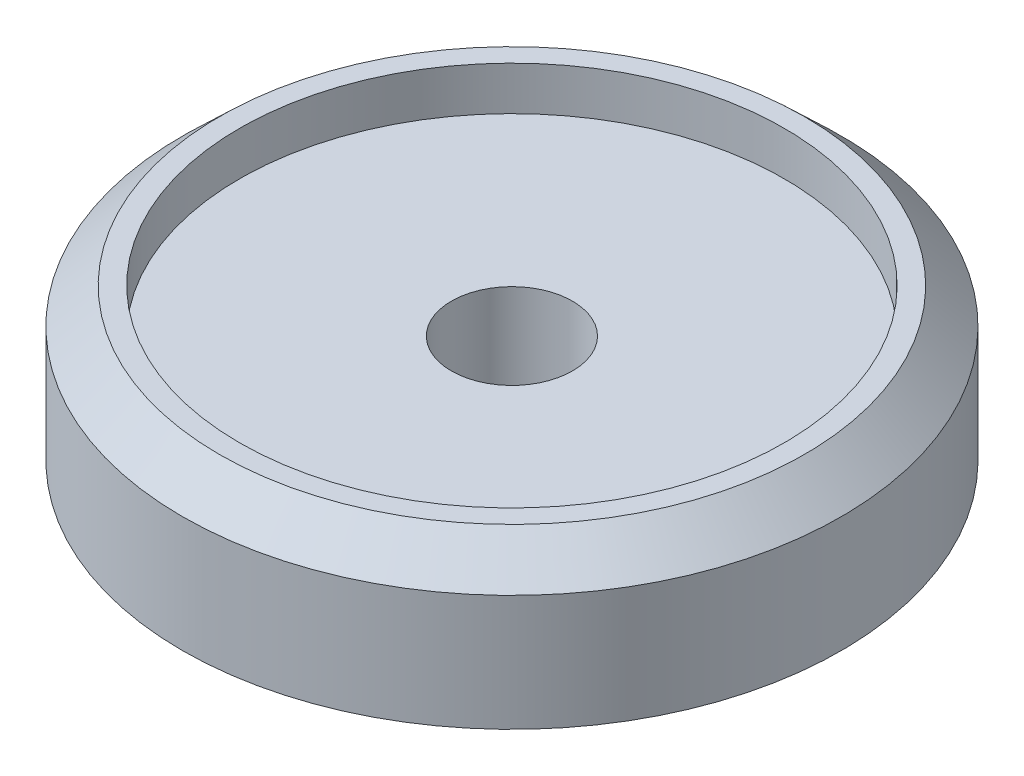
ISO-10303-21;
HEADER;
FILE_DESCRIPTION(('STEP AP214'),'2;1');
FILE_NAME('part.step','',(''),(''),'','','');
FILE_SCHEMA(('AUTOMOTIVE_DESIGN { 1 0 10303 214 1 1 1 1 }'));
ENDSEC;
DATA;
#1=APPLICATION_CONTEXT('core data for automotive mechanical design processes');
#2=APPLICATION_PROTOCOL_DEFINITION('international standard','automotive_design',2000,#1);
#3=PRODUCT_CONTEXT('',#1,'mechanical');
#4=PRODUCT('Part','Part','',(#3));
#5=PRODUCT_RELATED_PRODUCT_CATEGORY('part','',(#4));
#6=PRODUCT_DEFINITION_FORMATION('','',#4);
#7=PRODUCT_DEFINITION_CONTEXT('part definition',#1,'design');
#8=PRODUCT_DEFINITION('design','',#6,#7);
#9=PRODUCT_DEFINITION_SHAPE('','',#8);
#10=(LENGTH_UNIT() NAMED_UNIT(*) SI_UNIT(.MILLI.,.METRE.));
#11=(NAMED_UNIT(*) PLANE_ANGLE_UNIT() SI_UNIT($,.RADIAN.));
#12=(NAMED_UNIT(*) SI_UNIT($,.STERADIAN.) SOLID_ANGLE_UNIT());
#13=UNCERTAINTY_MEASURE_WITH_UNIT(LENGTH_MEASURE(1.E-05),#10,'distance_accuracy_value','');
#14=(GEOMETRIC_REPRESENTATION_CONTEXT(3) GLOBAL_UNCERTAINTY_ASSIGNED_CONTEXT((#13)) GLOBAL_UNIT_ASSIGNED_CONTEXT((#10,
#11,#12)) REPRESENTATION_CONTEXT('',''));
#15=CARTESIAN_POINT('',(0.,0.,0.));
#16=DIRECTION('',(0.,0.,1.));
#17=DIRECTION('',(1.,0.,0.));
#18=AXIS2_PLACEMENT_3D('',#15,#16,#17);
#19=CARTESIAN_POINT('',(0.,0.,0.));
#20=DIRECTION('',(0.,1.,0.));
#21=DIRECTION('',(0.,0.,1.));
#22=AXIS2_PLACEMENT_3D('',#19,#20,#21);
#23=PLANE('',#22);
#24=CARTESIAN_POINT('',(0.,0.,0.));
#25=DIRECTION('',(0.,1.,0.));
#26=DIRECTION('',(0.,0.,1.));
#27=AXIS2_PLACEMENT_3D('',#24,#25,#26);
#28=CIRCLE('',#27,49.);
#29=CARTESIAN_POINT('',(0.,0.,49.));
#30=VERTEX_POINT('',#29);
#31=EDGE_CURVE('E45',#30,#30,#28,.T.);
#32=ORIENTED_EDGE('',*,*,#31,.F.);
#33=EDGE_LOOP('',(#32));
#34=FACE_BOUND('',#33,.T.);
#35=CARTESIAN_POINT('',(0.,0.,0.));
#36=DIRECTION('',(0.,1.,0.));
#37=DIRECTION('',(0.,0.,1.));
#38=AXIS2_PLACEMENT_3D('',#35,#36,#37);
#39=CIRCLE('',#38,12.);
#40=CARTESIAN_POINT('',(0.,0.,12.));
#41=VERTEX_POINT('',#40);
#42=EDGE_CURVE('E10',#41,#41,#39,.F.);
#43=ORIENTED_EDGE('',*,*,#42,.F.);
#44=EDGE_LOOP('',(#43));
#45=FACE_BOUND('',#44,.T.);
#46=ADVANCED_FACE('F34',(#34,#45),#23,.F.);
#47=CARTESIAN_POINT('',(0.,16.,0.));
#48=DIRECTION('',(0.,-1.,0.));
#49=DIRECTION('',(0.,0.,-1.));
#50=AXIS2_PLACEMENT_3D('',#47,#48,#49);
#51=CYLINDRICAL_SURFACE('',#50,49.);
#52=ORIENTED_EDGE('',*,*,#31,.T.);
#53=EDGE_LOOP('',(#52));
#54=FACE_BOUND('',#53,.T.);
#55=CARTESIAN_POINT('',(0.,17.25,0.));
#56=DIRECTION('',(0.,1.,0.));
#57=DIRECTION('',(0.,0.,1.));
#58=AXIS2_PLACEMENT_3D('',#55,#56,#57);
#59=CIRCLE('',#58,49.);
#60=CARTESIAN_POINT('',(0.,17.25,49.));
#61=VERTEX_POINT('',#60);
#62=EDGE_CURVE('E49',#61,#61,#59,.T.);
#63=ORIENTED_EDGE('',*,*,#62,.F.);
#64=EDGE_LOOP('',(#63));
#65=FACE_BOUND('',#64,.T.);
#66=ADVANCED_FACE('F36',(#54,#65),#51,.T.);
#67=CARTESIAN_POINT('',(0.,22.5,0.));
#68=DIRECTION('',(0.,-1.,0.));
#69=DIRECTION('',(0.,0.,-1.));
#70=AXIS2_PLACEMENT_3D('',#67,#68,#69);
#71=CONICAL_SURFACE('',#70,43.5,0.80864978620791);
#72=ORIENTED_EDGE('',*,*,#62,.T.);
#73=EDGE_LOOP('',(#72));
#74=FACE_BOUND('',#73,.T.);
#75=CARTESIAN_POINT('',(0.,22.5,0.));
#76=DIRECTION('',(0.,1.,0.));
#77=DIRECTION('',(0.,0.,1.));
#78=AXIS2_PLACEMENT_3D('',#75,#76,#77);
#79=CIRCLE('',#78,43.5);
#80=CARTESIAN_POINT('',(0.,22.5,43.5));
#81=VERTEX_POINT('',#80);
#82=EDGE_CURVE('E57',#81,#81,#79,.T.);
#83=ORIENTED_EDGE('',*,*,#82,.F.);
#84=EDGE_LOOP('',(#83));
#85=FACE_BOUND('',#84,.T.);
#86=ADVANCED_FACE('F100',(#74,#85),#71,.T.);
#87=CARTESIAN_POINT('',(0.,16.,0.));
#88=DIRECTION('',(0.,1.,0.));
#89=DIRECTION('',(0.,0.,1.));
#90=AXIS2_PLACEMENT_3D('',#87,#88,#89);
#91=CYLINDRICAL_SURFACE('',#90,40.5);
#92=CARTESIAN_POINT('',(0.,22.5,0.));
#93=DIRECTION('',(0.,1.,0.));
#94=DIRECTION('',(0.,0.,1.));
#95=AXIS2_PLACEMENT_3D('',#92,#93,#94);
#96=CIRCLE('',#95,40.5);
#97=CARTESIAN_POINT('',(0.,22.5,40.5));
#98=VERTEX_POINT('',#97);
#99=EDGE_CURVE('E54',#98,#98,#96,.T.);
#100=ORIENTED_EDGE('',*,*,#99,.T.);
#101=EDGE_LOOP('',(#100));
#102=FACE_BOUND('',#101,.T.);
#103=CARTESIAN_POINT('',(0.,16.,0.));
#104=DIRECTION('',(0.,1.,0.));
#105=DIRECTION('',(0.,0.,1.));
#106=AXIS2_PLACEMENT_3D('',#103,#104,#105);
#107=CIRCLE('',#106,40.5);
#108=CARTESIAN_POINT('',(0.,16.,40.5));
#109=VERTEX_POINT('',#108);
#110=EDGE_CURVE('E41',#109,#109,#107,.F.);
#111=ORIENTED_EDGE('',*,*,#110,.T.);
#112=EDGE_LOOP('',(#111));
#113=FACE_BOUND('',#112,.T.);
#114=ADVANCED_FACE('F91',(#102,#113),#91,.F.);
#115=CARTESIAN_POINT('',(-43.5,22.5,0.));
#116=DIRECTION('',(0.,1.,0.));
#117=DIRECTION('',(0.,0.,1.));
#118=AXIS2_PLACEMENT_3D('',#115,#116,#117);
#119=PLANE('',#118);
#120=ORIENTED_EDGE('',*,*,#82,.T.);
#121=EDGE_LOOP('',(#120));
#122=FACE_BOUND('',#121,.T.);
#123=ORIENTED_EDGE('',*,*,#99,.F.);
#124=EDGE_LOOP('',(#123));
#125=FACE_BOUND('',#124,.T.);
#126=ADVANCED_FACE('F83',(#122,#125),#119,.T.);
#127=CARTESIAN_POINT('',(0.,16.,0.));
#128=DIRECTION('',(0.,1.,0.));
#129=DIRECTION('',(0.,0.,1.));
#130=AXIS2_PLACEMENT_3D('',#127,#128,#129);
#131=PLANE('',#130);
#132=CARTESIAN_POINT('',(0.,16.,0.));
#133=DIRECTION('',(0.,1.,0.));
#134=DIRECTION('',(0.,0.,1.));
#135=AXIS2_PLACEMENT_3D('',#132,#133,#134);
#136=CIRCLE('',#135,9.);
#137=CARTESIAN_POINT('',(0.,16.,9.));
#138=VERTEX_POINT('',#137);
#139=EDGE_CURVE('E64',#138,#138,#136,.T.);
#140=ORIENTED_EDGE('',*,*,#139,.F.);
#141=EDGE_LOOP('',(#140));
#142=FACE_BOUND('',#141,.T.);
#143=ORIENTED_EDGE('',*,*,#110,.F.);
#144=EDGE_LOOP('',(#143));
#145=FACE_BOUND('',#144,.T.);
#146=ADVANCED_FACE('F79',(#142,#145),#131,.T.);
#147=CARTESIAN_POINT('',(0.,-25.,0.));
#148=DIRECTION('',(0.,1.,0.));
#149=DIRECTION('',(0.,0.,1.));
#150=AXIS2_PLACEMENT_3D('',#147,#148,#149);
#151=CYLINDRICAL_SURFACE('',#150,12.);
#152=CARTESIAN_POINT('',(0.,-25.,0.));
#153=DIRECTION('',(0.,-1.,0.));
#154=DIRECTION('',(0.,0.,-1.));
#155=AXIS2_PLACEMENT_3D('',#152,#153,#154);
#156=CIRCLE('',#155,12.);
#157=CARTESIAN_POINT('',(0.,-25.,-12.));
#158=VERTEX_POINT('',#157);
#159=EDGE_CURVE('E60',#158,#158,#156,.T.);
#160=ORIENTED_EDGE('',*,*,#159,.F.);
#161=EDGE_LOOP('',(#160));
#162=FACE_BOUND('',#161,.T.);
#163=ORIENTED_EDGE('',*,*,#42,.T.);
#164=EDGE_LOOP('',(#163));
#165=FACE_BOUND('',#164,.T.);
#166=ADVANCED_FACE('F82',(#162,#165),#151,.T.);
#167=CARTESIAN_POINT('',(0.,-25.,0.));
#168=DIRECTION('',(0.,-1.,0.));
#169=DIRECTION('',(0.,0.,-1.));
#170=AXIS2_PLACEMENT_3D('',#167,#168,#169);
#171=PLANE('',#170);
#172=CARTESIAN_POINT('',(0.,-25.,0.));
#173=DIRECTION('',(0.,1.,0.));
#174=DIRECTION('',(0.,0.,1.));
#175=AXIS2_PLACEMENT_3D('',#172,#173,#174);
#176=CIRCLE('',#175,9.);
#177=CARTESIAN_POINT('',(0.,-25.,9.));
#178=VERTEX_POINT('',#177);
#179=EDGE_CURVE('E63',#178,#178,#176,.T.);
#180=ORIENTED_EDGE('',*,*,#179,.T.);
#181=EDGE_LOOP('',(#180));
#182=FACE_BOUND('',#181,.T.);
#183=ORIENTED_EDGE('',*,*,#159,.T.);
#184=EDGE_LOOP('',(#183));
#185=FACE_BOUND('',#184,.T.);
#186=ADVANCED_FACE('F70',(#182,#185),#171,.T.);
#187=CARTESIAN_POINT('',(0.,-25.,0.));
#188=DIRECTION('',(0.,1.,0.));
#189=DIRECTION('',(0.,0.,1.));
#190=AXIS2_PLACEMENT_3D('',#187,#188,#189);
#191=CYLINDRICAL_SURFACE('',#190,9.);
#192=ORIENTED_EDGE('',*,*,#179,.F.);
#193=EDGE_LOOP('',(#192));
#194=FACE_BOUND('',#193,.T.);
#195=ORIENTED_EDGE('',*,*,#139,.T.);
#196=EDGE_LOOP('',(#195));
#197=FACE_BOUND('',#196,.T.);
#198=ADVANCED_FACE('F73',(#194,#197),#191,.F.);
#199=CLOSED_SHELL('',(#46,#66,#86,#114,#126,#146,#166,#186,#198));
#200=MANIFOLD_SOLID_BREP('B2',#199);
#201=ADVANCED_BREP_SHAPE_REPRESENTATION('',(#18,#200),#14);
#202=SHAPE_DEFINITION_REPRESENTATION(#9,#201);
ENDSEC;
END-ISO-10303-21;
